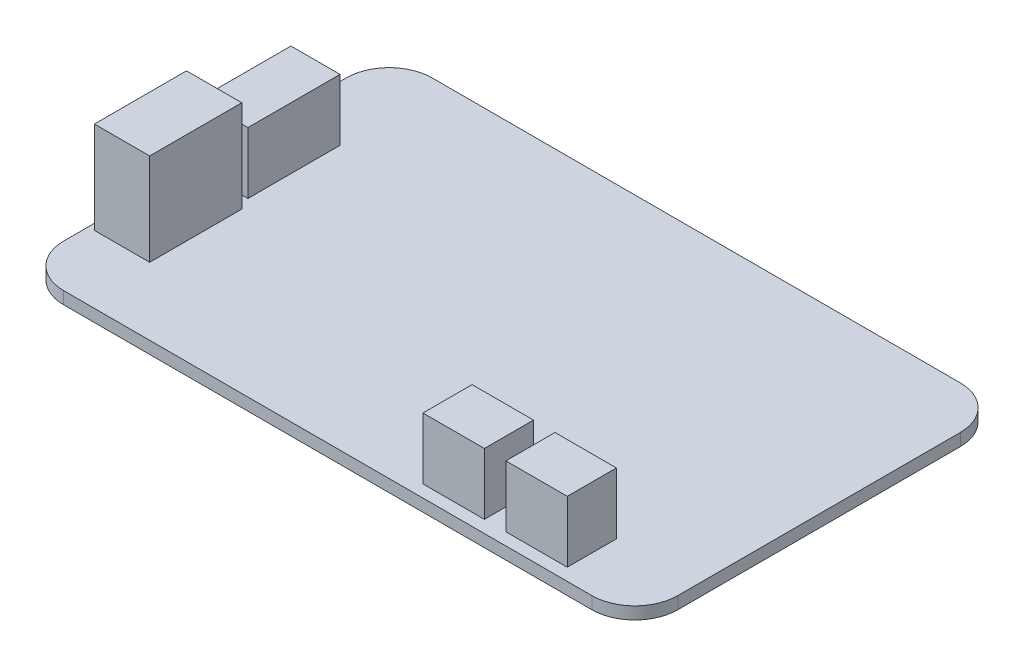
ISO-10303-21;
HEADER;
FILE_DESCRIPTION(('STEP AP214'),'2;1');
FILE_NAME('part.step','',(''),(''),'','','');
FILE_SCHEMA(('AUTOMOTIVE_DESIGN { 1 0 10303 214 1 1 1 1 }'));
ENDSEC;
DATA;
#1=APPLICATION_CONTEXT('core data for automotive mechanical design processes');
#2=APPLICATION_PROTOCOL_DEFINITION('international standard','automotive_design',2000,#1);
#3=PRODUCT_CONTEXT('',#1,'mechanical');
#4=PRODUCT('Part','Part','',(#3));
#5=PRODUCT_RELATED_PRODUCT_CATEGORY('part','',(#4));
#6=PRODUCT_DEFINITION_FORMATION('','',#4);
#7=PRODUCT_DEFINITION_CONTEXT('part definition',#1,'design');
#8=PRODUCT_DEFINITION('design','',#6,#7);
#9=PRODUCT_DEFINITION_SHAPE('','',#8);
#10=(LENGTH_UNIT() NAMED_UNIT(*) SI_UNIT(.MILLI.,.METRE.));
#11=(NAMED_UNIT(*) PLANE_ANGLE_UNIT() SI_UNIT($,.RADIAN.));
#12=(NAMED_UNIT(*) SI_UNIT($,.STERADIAN.) SOLID_ANGLE_UNIT());
#13=UNCERTAINTY_MEASURE_WITH_UNIT(LENGTH_MEASURE(1.E-05),#10,'distance_accuracy_value','');
#14=(GEOMETRIC_REPRESENTATION_CONTEXT(3) GLOBAL_UNCERTAINTY_ASSIGNED_CONTEXT((#13)) GLOBAL_UNIT_ASSIGNED_CONTEXT((#10,
#11,#12)) REPRESENTATION_CONTEXT('',''));
#15=CARTESIAN_POINT('',(0.,0.,0.));
#16=DIRECTION('',(0.,0.,1.));
#17=DIRECTION('',(1.,0.,0.));
#18=AXIS2_PLACEMENT_3D('',#15,#16,#17);
#19=CARTESIAN_POINT('',(0.,2.,0.));
#20=DIRECTION('',(0.,1.,0.));
#21=DIRECTION('',(0.,0.,1.));
#22=AXIS2_PLACEMENT_3D('',#19,#20,#21);
#23=PLANE('',#22);
#24=DIRECTION('',(0.,0.,1.));
#25=VECTOR('',#24,1.);
#26=CARTESIAN_POINT('',(-50.,2.,-30.));
#27=LINE('',#26,#25);
#28=CARTESIAN_POINT('',(-50.,2.,-23.));
#29=VERTEX_POINT('',#28);
#30=CARTESIAN_POINT('',(-50.,2.,23.));
#31=VERTEX_POINT('',#30);
#32=EDGE_CURVE('E358',#29,#31,#27,.T.);
#33=ORIENTED_EDGE('',*,*,#32,.T.);
#34=CARTESIAN_POINT('',(-43.,2.,23.));
#35=DIRECTION('',(0.,1.,0.));
#36=DIRECTION('',(0.,0.,1.));
#37=AXIS2_PLACEMENT_3D('',#34,#35,#36);
#38=CIRCLE('',#37,7.);
#39=CARTESIAN_POINT('',(-43.,2.,30.));
#40=VERTEX_POINT('',#39);
#41=EDGE_CURVE('E11',#31,#40,#38,.T.);
#42=ORIENTED_EDGE('',*,*,#41,.T.);
#43=DIRECTION('',(1.,0.,0.));
#44=VECTOR('',#43,1.);
#45=CARTESIAN_POINT('',(-50.,2.,30.));
#46=LINE('',#45,#44);
#47=CARTESIAN_POINT('',(43.,2.,30.));
#48=VERTEX_POINT('',#47);
#49=EDGE_CURVE('E362',#40,#48,#46,.T.);
#50=ORIENTED_EDGE('',*,*,#49,.T.);
#51=CARTESIAN_POINT('',(43.,2.,23.));
#52=DIRECTION('',(0.,1.,0.));
#53=DIRECTION('',(0.,0.,1.));
#54=AXIS2_PLACEMENT_3D('',#51,#52,#53);
#55=CIRCLE('',#54,7.);
#56=CARTESIAN_POINT('',(50.,2.,23.));
#57=VERTEX_POINT('',#56);
#58=EDGE_CURVE('E399',#48,#57,#55,.T.);
#59=ORIENTED_EDGE('',*,*,#58,.T.);
#60=DIRECTION('',(0.,0.,-1.));
#61=VECTOR('',#60,1.);
#62=CARTESIAN_POINT('',(50.,2.,-30.));
#63=LINE('',#62,#61);
#64=CARTESIAN_POINT('',(50.,2.,-23.));
#65=VERTEX_POINT('',#64);
#66=EDGE_CURVE('E366',#57,#65,#63,.T.);
#67=ORIENTED_EDGE('',*,*,#66,.T.);
#68=CARTESIAN_POINT('',(43.,2.,-23.));
#69=DIRECTION('',(0.,1.,0.));
#70=DIRECTION('',(0.,0.,1.));
#71=AXIS2_PLACEMENT_3D('',#68,#69,#70);
#72=CIRCLE('',#71,7.);
#73=CARTESIAN_POINT('',(43.,2.,-30.));
#74=VERTEX_POINT('',#73);
#75=EDGE_CURVE('E413',#65,#74,#72,.T.);
#76=ORIENTED_EDGE('',*,*,#75,.T.);
#77=DIRECTION('',(-1.,0.,0.));
#78=VECTOR('',#77,1.);
#79=CARTESIAN_POINT('',(-50.,2.,-30.));
#80=LINE('',#79,#78);
#81=CARTESIAN_POINT('',(-43.,2.,-30.));
#82=VERTEX_POINT('',#81);
#83=EDGE_CURVE('E370',#74,#82,#80,.T.);
#84=ORIENTED_EDGE('',*,*,#83,.T.);
#85=CARTESIAN_POINT('',(-43.,2.,-23.));
#86=DIRECTION('',(0.,1.,0.));
#87=DIRECTION('',(0.,0.,1.));
#88=AXIS2_PLACEMENT_3D('',#85,#86,#87);
#89=CIRCLE('',#88,7.);
#90=EDGE_CURVE('E427',#82,#29,#89,.T.);
#91=ORIENTED_EDGE('',*,*,#90,.T.);
#92=EDGE_LOOP('',(#33,#42,#50,#59,#67,#76,#84,#91));
#93=FACE_BOUND('',#92,.T.);
#94=DIRECTION('',(1.,0.,0.));
#95=VECTOR('',#94,1.);
#96=CARTESIAN_POINT('',(-49.,2.,2.));
#97=LINE('',#96,#95);
#98=CARTESIAN_POINT('',(-49.,2.,2.));
#99=VERTEX_POINT('',#98);
#100=CARTESIAN_POINT('',(-41.,2.,2.));
#101=VERTEX_POINT('',#100);
#102=EDGE_CURVE('E335',#99,#101,#97,.T.);
#103=ORIENTED_EDGE('',*,*,#102,.F.);
#104=DIRECTION('',(0.,0.,1.));
#105=VECTOR('',#104,1.);
#106=CARTESIAN_POINT('',(-49.,2.,-13.));
#107=LINE('',#106,#105);
#108=CARTESIAN_POINT('',(-49.,2.,-13.));
#109=VERTEX_POINT('',#108);
#110=EDGE_CURVE('E316',#109,#99,#107,.T.);
#111=ORIENTED_EDGE('',*,*,#110,.F.);
#112=DIRECTION('',(-1.,0.,0.));
#113=VECTOR('',#112,1.);
#114=CARTESIAN_POINT('',(-49.,2.,-13.));
#115=LINE('',#114,#113);
#116=CARTESIAN_POINT('',(-41.,2.,-13.));
#117=VERTEX_POINT('',#116);
#118=EDGE_CURVE('E322',#117,#109,#115,.T.);
#119=ORIENTED_EDGE('',*,*,#118,.F.);
#120=DIRECTION('',(0.,0.,-1.));
#121=VECTOR('',#120,1.);
#122=CARTESIAN_POINT('',(-41.,2.,-13.));
#123=LINE('',#122,#121);
#124=EDGE_CURVE('E338',#101,#117,#123,.T.);
#125=ORIENTED_EDGE('',*,*,#124,.F.);
#126=EDGE_LOOP('',(#103,#111,#119,#125));
#127=FACE_BOUND('',#126,.T.);
#128=DIRECTION('',(1.,0.,0.));
#129=VECTOR('',#128,1.);
#130=CARTESIAN_POINT('',(-49.,2.,19.));
#131=LINE('',#130,#129);
#132=CARTESIAN_POINT('',(-49.,2.,19.));
#133=VERTEX_POINT('',#132);
#134=CARTESIAN_POINT('',(-40.,2.,19.));
#135=VERTEX_POINT('',#134);
#136=EDGE_CURVE('E294',#133,#135,#131,.T.);
#137=ORIENTED_EDGE('',*,*,#136,.F.);
#138=DIRECTION('',(0.,0.,1.));
#139=VECTOR('',#138,1.);
#140=CARTESIAN_POINT('',(-49.,2.,4.));
#141=LINE('',#140,#139);
#142=CARTESIAN_POINT('',(-49.,2.,4.));
#143=VERTEX_POINT('',#142);
#144=EDGE_CURVE('E275',#143,#133,#141,.T.);
#145=ORIENTED_EDGE('',*,*,#144,.F.);
#146=DIRECTION('',(-1.,0.,0.));
#147=VECTOR('',#146,1.);
#148=CARTESIAN_POINT('',(-49.,2.,4.));
#149=LINE('',#148,#147);
#150=CARTESIAN_POINT('',(-40.,2.,4.));
#151=VERTEX_POINT('',#150);
#152=EDGE_CURVE('E281',#151,#143,#149,.T.);
#153=ORIENTED_EDGE('',*,*,#152,.F.);
#154=DIRECTION('',(0.,0.,-1.));
#155=VECTOR('',#154,1.);
#156=CARTESIAN_POINT('',(-40.,2.,4.));
#157=LINE('',#156,#155);
#158=EDGE_CURVE('E297',#135,#151,#157,.T.);
#159=ORIENTED_EDGE('',*,*,#158,.F.);
#160=EDGE_LOOP('',(#137,#145,#153,#159));
#161=FACE_BOUND('',#160,.T.);
#162=DIRECTION('',(1.,0.,0.));
#163=VECTOR('',#162,1.);
#164=CARTESIAN_POINT('',(27.,2.,28.));
#165=LINE('',#164,#163);
#166=CARTESIAN_POINT('',(27.,2.,28.));
#167=VERTEX_POINT('',#166);
#168=CARTESIAN_POINT('',(37.,2.,28.));
#169=VERTEX_POINT('',#168);
#170=EDGE_CURVE('E236',#167,#169,#165,.T.);
#171=ORIENTED_EDGE('',*,*,#170,.F.);
#172=DIRECTION('',(0.,0.,1.));
#173=VECTOR('',#172,1.);
#174=CARTESIAN_POINT('',(27.,2.,20.));
#175=LINE('',#174,#173);
#176=CARTESIAN_POINT('',(27.,2.,20.));
#177=VERTEX_POINT('',#176);
#178=EDGE_CURVE('E231',#177,#167,#175,.T.);
#179=ORIENTED_EDGE('',*,*,#178,.F.);
#180=DIRECTION('',(-1.,0.,0.));
#181=VECTOR('',#180,1.);
#182=CARTESIAN_POINT('',(27.,2.,20.));
#183=LINE('',#182,#181);
#184=CARTESIAN_POINT('',(37.,2.,20.));
#185=VERTEX_POINT('',#184);
#186=EDGE_CURVE('E246',#185,#177,#183,.T.);
#187=ORIENTED_EDGE('',*,*,#186,.F.);
#188=DIRECTION('',(0.,0.,-1.));
#189=VECTOR('',#188,1.);
#190=CARTESIAN_POINT('',(37.,2.,20.));
#191=LINE('',#190,#189);
#192=EDGE_CURVE('E258',#169,#185,#191,.T.);
#193=ORIENTED_EDGE('',*,*,#192,.F.);
#194=EDGE_LOOP('',(#171,#179,#187,#193));
#195=FACE_BOUND('',#194,.T.);
#196=DIRECTION('',(0.,0.,1.));
#197=VECTOR('',#196,1.);
#198=CARTESIAN_POINT('',(13.5,2.,20.));
#199=LINE('',#198,#197);
#200=CARTESIAN_POINT('',(13.5,2.,20.));
#201=VERTEX_POINT('',#200);
#202=CARTESIAN_POINT('',(13.5,2.,28.));
#203=VERTEX_POINT('',#202);
#204=EDGE_CURVE('E489',#201,#203,#199,.T.);
#205=ORIENTED_EDGE('',*,*,#204,.F.);
#206=DIRECTION('',(-1.,0.,0.));
#207=VECTOR('',#206,1.);
#208=CARTESIAN_POINT('',(23.5,2.,20.));
#209=LINE('',#208,#207);
#210=CARTESIAN_POINT('',(23.5,2.,20.));
#211=VERTEX_POINT('',#210);
#212=EDGE_CURVE('E228',#211,#201,#209,.T.);
#213=ORIENTED_EDGE('',*,*,#212,.F.);
#214=DIRECTION('',(0.,0.,-1.));
#215=VECTOR('',#214,1.);
#216=CARTESIAN_POINT('',(23.5,2.,20.));
#217=LINE('',#216,#215);
#218=CARTESIAN_POINT('',(23.5,2.,28.));
#219=VERTEX_POINT('',#218);
#220=EDGE_CURVE('E224',#219,#211,#217,.T.);
#221=ORIENTED_EDGE('',*,*,#220,.F.);
#222=DIRECTION('',(1.,0.,0.));
#223=VECTOR('',#222,1.);
#224=CARTESIAN_POINT('',(23.5,2.,28.));
#225=LINE('',#224,#223);
#226=EDGE_CURVE('E491',#203,#219,#225,.T.);
#227=ORIENTED_EDGE('',*,*,#226,.F.);
#228=EDGE_LOOP('',(#205,#213,#221,#227));
#229=FACE_BOUND('',#228,.T.);
#230=ADVANCED_FACE('F41',(#93,#127,#161,#195,#229),#23,.T.);
#231=CARTESIAN_POINT('',(-43.,2.,23.));
#232=DIRECTION('',(0.,1.,0.));
#233=DIRECTION('',(0.,0.,1.));
#234=AXIS2_PLACEMENT_3D('',#231,#232,#233);
#235=CYLINDRICAL_SURFACE('',#234,7.);
#236=DIRECTION('',(0.,1.,0.));
#237=VECTOR('',#236,1.);
#238=CARTESIAN_POINT('',(-50.,2.,23.));
#239=LINE('',#238,#237);
#240=CARTESIAN_POINT('',(-50.,0.,23.));
#241=VERTEX_POINT('',#240);
#242=EDGE_CURVE('E430',#241,#31,#239,.T.);
#243=ORIENTED_EDGE('',*,*,#242,.F.);
#244=CARTESIAN_POINT('',(-43.,0.,23.));
#245=DIRECTION('',(0.,1.,0.));
#246=DIRECTION('',(0.,0.,1.));
#247=AXIS2_PLACEMENT_3D('',#244,#245,#246);
#248=CIRCLE('',#247,7.);
#249=CARTESIAN_POINT('',(-43.,0.,30.));
#250=VERTEX_POINT('',#249);
#251=EDGE_CURVE('E50',#250,#241,#248,.F.);
#252=ORIENTED_EDGE('',*,*,#251,.F.);
#253=DIRECTION('',(0.,1.,0.));
#254=VECTOR('',#253,1.);
#255=CARTESIAN_POINT('',(-43.,2.,30.));
#256=LINE('',#255,#254);
#257=EDGE_CURVE('E434',#40,#250,#256,.F.);
#258=ORIENTED_EDGE('',*,*,#257,.F.);
#259=ORIENTED_EDGE('',*,*,#41,.F.);
#260=EDGE_LOOP('',(#243,#252,#258,#259));
#261=FACE_BOUND('',#260,.T.);
#262=ADVANCED_FACE('F43',(#261),#235,.T.);
#263=CARTESIAN_POINT('',(-43.,2.,-23.));
#264=DIRECTION('',(0.,1.,0.));
#265=DIRECTION('',(0.,0.,1.));
#266=AXIS2_PLACEMENT_3D('',#263,#264,#265);
#267=CYLINDRICAL_SURFACE('',#266,7.);
#268=DIRECTION('',(0.,1.,0.));
#269=VECTOR('',#268,1.);
#270=CARTESIAN_POINT('',(-43.,2.,-30.));
#271=LINE('',#270,#269);
#272=CARTESIAN_POINT('',(-43.,0.,-30.));
#273=VERTEX_POINT('',#272);
#274=EDGE_CURVE('E416',#273,#82,#271,.T.);
#275=ORIENTED_EDGE('',*,*,#274,.F.);
#276=CARTESIAN_POINT('',(-43.,0.,-23.));
#277=DIRECTION('',(0.,1.,0.));
#278=DIRECTION('',(0.,0.,1.));
#279=AXIS2_PLACEMENT_3D('',#276,#277,#278);
#280=CIRCLE('',#279,7.);
#281=CARTESIAN_POINT('',(-50.,0.,-23.));
#282=VERTEX_POINT('',#281);
#283=EDGE_CURVE('E424',#282,#273,#280,.F.);
#284=ORIENTED_EDGE('',*,*,#283,.F.);
#285=DIRECTION('',(0.,1.,0.));
#286=VECTOR('',#285,1.);
#287=CARTESIAN_POINT('',(-50.,2.,-23.));
#288=LINE('',#287,#286);
#289=EDGE_CURVE('E420',#29,#282,#288,.F.);
#290=ORIENTED_EDGE('',*,*,#289,.F.);
#291=ORIENTED_EDGE('',*,*,#90,.F.);
#292=EDGE_LOOP('',(#275,#284,#290,#291));
#293=FACE_BOUND('',#292,.T.);
#294=ADVANCED_FACE('F451',(#293),#267,.T.);
#295=CARTESIAN_POINT('',(43.,2.,-23.));
#296=DIRECTION('',(0.,1.,0.));
#297=DIRECTION('',(0.,0.,1.));
#298=AXIS2_PLACEMENT_3D('',#295,#296,#297);
#299=CYLINDRICAL_SURFACE('',#298,7.);
#300=DIRECTION('',(0.,1.,0.));
#301=VECTOR('',#300,1.);
#302=CARTESIAN_POINT('',(50.,2.,-23.));
#303=LINE('',#302,#301);
#304=CARTESIAN_POINT('',(50.,0.,-23.));
#305=VERTEX_POINT('',#304);
#306=EDGE_CURVE('E402',#305,#65,#303,.T.);
#307=ORIENTED_EDGE('',*,*,#306,.F.);
#308=CARTESIAN_POINT('',(43.,0.,-23.));
#309=DIRECTION('',(0.,1.,0.));
#310=DIRECTION('',(0.,0.,1.));
#311=AXIS2_PLACEMENT_3D('',#308,#309,#310);
#312=CIRCLE('',#311,7.);
#313=CARTESIAN_POINT('',(43.,0.,-30.));
#314=VERTEX_POINT('',#313);
#315=EDGE_CURVE('E410',#314,#305,#312,.F.);
#316=ORIENTED_EDGE('',*,*,#315,.F.);
#317=DIRECTION('',(0.,1.,0.));
#318=VECTOR('',#317,1.);
#319=CARTESIAN_POINT('',(43.,2.,-30.));
#320=LINE('',#319,#318);
#321=EDGE_CURVE('E406',#74,#314,#320,.F.);
#322=ORIENTED_EDGE('',*,*,#321,.F.);
#323=ORIENTED_EDGE('',*,*,#75,.F.);
#324=EDGE_LOOP('',(#307,#316,#322,#323));
#325=FACE_BOUND('',#324,.T.);
#326=ADVANCED_FACE('F460',(#325),#299,.T.);
#327=CARTESIAN_POINT('',(43.,2.,23.));
#328=DIRECTION('',(0.,1.,0.));
#329=DIRECTION('',(0.,0.,1.));
#330=AXIS2_PLACEMENT_3D('',#327,#328,#329);
#331=CYLINDRICAL_SURFACE('',#330,7.);
#332=DIRECTION('',(0.,1.,0.));
#333=VECTOR('',#332,1.);
#334=CARTESIAN_POINT('',(43.,2.,30.));
#335=LINE('',#334,#333);
#336=CARTESIAN_POINT('',(43.,0.,30.));
#337=VERTEX_POINT('',#336);
#338=EDGE_CURVE('E374',#337,#48,#335,.T.);
#339=ORIENTED_EDGE('',*,*,#338,.F.);
#340=CARTESIAN_POINT('',(43.,0.,23.));
#341=DIRECTION('',(0.,1.,0.));
#342=DIRECTION('',(0.,0.,1.));
#343=AXIS2_PLACEMENT_3D('',#340,#341,#342);
#344=CIRCLE('',#343,7.);
#345=CARTESIAN_POINT('',(50.,0.,23.));
#346=VERTEX_POINT('',#345);
#347=EDGE_CURVE('E395',#346,#337,#344,.F.);
#348=ORIENTED_EDGE('',*,*,#347,.F.);
#349=DIRECTION('',(0.,1.,0.));
#350=VECTOR('',#349,1.);
#351=CARTESIAN_POINT('',(50.,2.,23.));
#352=LINE('',#351,#350);
#353=EDGE_CURVE('E391',#57,#346,#352,.F.);
#354=ORIENTED_EDGE('',*,*,#353,.F.);
#355=ORIENTED_EDGE('',*,*,#58,.F.);
#356=EDGE_LOOP('',(#339,#348,#354,#355));
#357=FACE_BOUND('',#356,.T.);
#358=ADVANCED_FACE('F468',(#357),#331,.T.);
#359=CARTESIAN_POINT('',(-50.,2.,-30.));
#360=DIRECTION('',(1.,0.,0.));
#361=DIRECTION('',(0.,0.,-1.));
#362=AXIS2_PLACEMENT_3D('',#359,#360,#361);
#363=PLANE('',#362);
#364=DIRECTION('',(0.,0.,1.));
#365=VECTOR('',#364,1.);
#366=CARTESIAN_POINT('',(-50.,0.,-30.));
#367=LINE('',#366,#365);
#368=EDGE_CURVE('E357',#282,#241,#367,.T.);
#369=ORIENTED_EDGE('',*,*,#368,.T.);
#370=ORIENTED_EDGE('',*,*,#242,.T.);
#371=ORIENTED_EDGE('',*,*,#32,.F.);
#372=ORIENTED_EDGE('',*,*,#289,.T.);
#373=EDGE_LOOP('',(#369,#370,#371,#372));
#374=FACE_BOUND('',#373,.T.);
#375=ADVANCED_FACE('F447',(#374),#363,.F.);
#376=CARTESIAN_POINT('',(-50.,2.,30.));
#377=DIRECTION('',(0.,0.,-1.));
#378=DIRECTION('',(-1.,0.,0.));
#379=AXIS2_PLACEMENT_3D('',#376,#377,#378);
#380=PLANE('',#379);
#381=ORIENTED_EDGE('',*,*,#49,.F.);
#382=ORIENTED_EDGE('',*,*,#257,.T.);
#383=DIRECTION('',(1.,0.,0.));
#384=VECTOR('',#383,1.);
#385=CARTESIAN_POINT('',(-50.,0.,30.));
#386=LINE('',#385,#384);
#387=EDGE_CURVE('E378',#250,#337,#386,.T.);
#388=ORIENTED_EDGE('',*,*,#387,.T.);
#389=ORIENTED_EDGE('',*,*,#338,.T.);
#390=EDGE_LOOP('',(#381,#382,#388,#389));
#391=FACE_BOUND('',#390,.T.);
#392=ADVANCED_FACE('F471',(#391),#380,.F.);
#393=CARTESIAN_POINT('',(50.,2.,-30.));
#394=DIRECTION('',(-1.,0.,0.));
#395=DIRECTION('',(0.,0.,1.));
#396=AXIS2_PLACEMENT_3D('',#393,#394,#395);
#397=PLANE('',#396);
#398=DIRECTION('',(0.,0.,-1.));
#399=VECTOR('',#398,1.);
#400=CARTESIAN_POINT('',(50.,0.,-30.));
#401=LINE('',#400,#399);
#402=EDGE_CURVE('E381',#346,#305,#401,.T.);
#403=ORIENTED_EDGE('',*,*,#402,.T.);
#404=ORIENTED_EDGE('',*,*,#306,.T.);
#405=ORIENTED_EDGE('',*,*,#66,.F.);
#406=ORIENTED_EDGE('',*,*,#353,.T.);
#407=EDGE_LOOP('',(#403,#404,#405,#406));
#408=FACE_BOUND('',#407,.T.);
#409=ADVANCED_FACE('F463',(#408),#397,.F.);
#410=CARTESIAN_POINT('',(-50.,2.,-30.));
#411=DIRECTION('',(0.,0.,1.));
#412=DIRECTION('',(1.,0.,0.));
#413=AXIS2_PLACEMENT_3D('',#410,#411,#412);
#414=PLANE('',#413);
#415=DIRECTION('',(-1.,0.,0.));
#416=VECTOR('',#415,1.);
#417=CARTESIAN_POINT('',(-50.,0.,-30.));
#418=LINE('',#417,#416);
#419=EDGE_CURVE('E363',#314,#273,#418,.T.);
#420=ORIENTED_EDGE('',*,*,#419,.T.);
#421=ORIENTED_EDGE('',*,*,#274,.T.);
#422=ORIENTED_EDGE('',*,*,#83,.F.);
#423=ORIENTED_EDGE('',*,*,#321,.T.);
#424=EDGE_LOOP('',(#420,#421,#422,#423));
#425=FACE_BOUND('',#424,.T.);
#426=ADVANCED_FACE('F456',(#425),#414,.F.);
#427=CARTESIAN_POINT('',(0.,0.,0.));
#428=DIRECTION('',(0.,1.,0.));
#429=DIRECTION('',(0.,0.,1.));
#430=AXIS2_PLACEMENT_3D('',#427,#428,#429);
#431=PLANE('',#430);
#432=ORIENTED_EDGE('',*,*,#387,.F.);
#433=ORIENTED_EDGE('',*,*,#251,.T.);
#434=ORIENTED_EDGE('',*,*,#368,.F.);
#435=ORIENTED_EDGE('',*,*,#283,.T.);
#436=ORIENTED_EDGE('',*,*,#419,.F.);
#437=ORIENTED_EDGE('',*,*,#315,.T.);
#438=ORIENTED_EDGE('',*,*,#402,.F.);
#439=ORIENTED_EDGE('',*,*,#347,.T.);
#440=EDGE_LOOP('',(#432,#433,#434,#435,#436,#437,#438,#439));
#441=FACE_BOUND('',#440,.T.);
#442=ADVANCED_FACE('F442',(#441),#431,.F.);
#443=CARTESIAN_POINT('',(-49.,12.,-13.));
#444=DIRECTION('',(1.,0.,0.));
#445=DIRECTION('',(0.,0.,-1.));
#446=AXIS2_PLACEMENT_3D('',#443,#444,#445);
#447=PLANE('',#446);
#448=ORIENTED_EDGE('',*,*,#110,.T.);
#449=DIRECTION('',(0.,-1.,0.));
#450=VECTOR('',#449,1.);
#451=CARTESIAN_POINT('',(-49.,12.,2.));
#452=LINE('',#451,#450);
#453=CARTESIAN_POINT('',(-49.,12.,2.));
#454=VERTEX_POINT('',#453);
#455=EDGE_CURVE('E354',#454,#99,#452,.T.);
#456=ORIENTED_EDGE('',*,*,#455,.F.);
#457=DIRECTION('',(0.,0.,1.));
#458=VECTOR('',#457,1.);
#459=CARTESIAN_POINT('',(-49.,12.,-13.));
#460=LINE('',#459,#458);
#461=CARTESIAN_POINT('',(-49.,12.,-13.));
#462=VERTEX_POINT('',#461);
#463=EDGE_CURVE('E317',#462,#454,#460,.T.);
#464=ORIENTED_EDGE('',*,*,#463,.F.);
#465=DIRECTION('',(0.,-1.,0.));
#466=VECTOR('',#465,1.);
#467=CARTESIAN_POINT('',(-49.,12.,-13.));
#468=LINE('',#467,#466);
#469=EDGE_CURVE('E331',#462,#109,#468,.T.);
#470=ORIENTED_EDGE('',*,*,#469,.T.);
#471=EDGE_LOOP('',(#448,#456,#464,#470));
#472=FACE_BOUND('',#471,.T.);
#473=ADVANCED_FACE('F578',(#472),#447,.F.);
#474=CARTESIAN_POINT('',(-49.,12.,2.));
#475=DIRECTION('',(0.,0.,-1.));
#476=DIRECTION('',(-1.,0.,0.));
#477=AXIS2_PLACEMENT_3D('',#474,#475,#476);
#478=PLANE('',#477);
#479=ORIENTED_EDGE('',*,*,#102,.T.);
#480=DIRECTION('',(0.,-1.,0.));
#481=VECTOR('',#480,1.);
#482=CARTESIAN_POINT('',(-41.,12.,2.));
#483=LINE('',#482,#481);
#484=CARTESIAN_POINT('',(-41.,12.,2.));
#485=VERTEX_POINT('',#484);
#486=EDGE_CURVE('E350',#485,#101,#483,.T.);
#487=ORIENTED_EDGE('',*,*,#486,.F.);
#488=DIRECTION('',(1.,0.,0.));
#489=VECTOR('',#488,1.);
#490=CARTESIAN_POINT('',(-49.,12.,2.));
#491=LINE('',#490,#489);
#492=EDGE_CURVE('E321',#454,#485,#491,.T.);
#493=ORIENTED_EDGE('',*,*,#492,.F.);
#494=ORIENTED_EDGE('',*,*,#455,.T.);
#495=EDGE_LOOP('',(#479,#487,#493,#494));
#496=FACE_BOUND('',#495,.T.);
#497=ADVANCED_FACE('F574',(#496),#478,.F.);
#498=CARTESIAN_POINT('',(-41.,12.,-13.));
#499=DIRECTION('',(-1.,0.,0.));
#500=DIRECTION('',(0.,0.,1.));
#501=AXIS2_PLACEMENT_3D('',#498,#499,#500);
#502=PLANE('',#501);
#503=ORIENTED_EDGE('',*,*,#124,.T.);
#504=DIRECTION('',(0.,-1.,0.));
#505=VECTOR('',#504,1.);
#506=CARTESIAN_POINT('',(-41.,12.,-13.));
#507=LINE('',#506,#505);
#508=CARTESIAN_POINT('',(-41.,12.,-13.));
#509=VERTEX_POINT('',#508);
#510=EDGE_CURVE('E347',#509,#117,#507,.T.);
#511=ORIENTED_EDGE('',*,*,#510,.F.);
#512=DIRECTION('',(0.,0.,-1.));
#513=VECTOR('',#512,1.);
#514=CARTESIAN_POINT('',(-41.,12.,-13.));
#515=LINE('',#514,#513);
#516=EDGE_CURVE('E325',#485,#509,#515,.T.);
#517=ORIENTED_EDGE('',*,*,#516,.F.);
#518=ORIENTED_EDGE('',*,*,#486,.T.);
#519=EDGE_LOOP('',(#503,#511,#517,#518));
#520=FACE_BOUND('',#519,.T.);
#521=ADVANCED_FACE('F570',(#520),#502,.F.);
#522=CARTESIAN_POINT('',(-49.,12.,-13.));
#523=DIRECTION('',(0.,0.,1.));
#524=DIRECTION('',(1.,0.,0.));
#525=AXIS2_PLACEMENT_3D('',#522,#523,#524);
#526=PLANE('',#525);
#527=ORIENTED_EDGE('',*,*,#118,.T.);
#528=ORIENTED_EDGE('',*,*,#469,.F.);
#529=DIRECTION('',(-1.,0.,0.));
#530=VECTOR('',#529,1.);
#531=CARTESIAN_POINT('',(-49.,12.,-13.));
#532=LINE('',#531,#530);
#533=EDGE_CURVE('E328',#509,#462,#532,.T.);
#534=ORIENTED_EDGE('',*,*,#533,.F.);
#535=ORIENTED_EDGE('',*,*,#510,.T.);
#536=EDGE_LOOP('',(#527,#528,#534,#535));
#537=FACE_BOUND('',#536,.T.);
#538=ADVANCED_FACE('F566',(#537),#526,.F.);
#539=CARTESIAN_POINT('',(0.,12.,0.));
#540=DIRECTION('',(0.,1.,0.));
#541=DIRECTION('',(0.,0.,1.));
#542=AXIS2_PLACEMENT_3D('',#539,#540,#541);
#543=PLANE('',#542);
#544=ORIENTED_EDGE('',*,*,#463,.T.);
#545=ORIENTED_EDGE('',*,*,#492,.T.);
#546=ORIENTED_EDGE('',*,*,#516,.T.);
#547=ORIENTED_EDGE('',*,*,#533,.T.);
#548=EDGE_LOOP('',(#544,#545,#546,#547));
#549=FACE_BOUND('',#548,.T.);
#550=ADVANCED_FACE('F562',(#549),#543,.T.);
#551=CARTESIAN_POINT('',(-49.,17.,4.));
#552=DIRECTION('',(1.,0.,0.));
#553=DIRECTION('',(0.,0.,-1.));
#554=AXIS2_PLACEMENT_3D('',#551,#552,#553);
#555=PLANE('',#554);
#556=ORIENTED_EDGE('',*,*,#144,.T.);
#557=DIRECTION('',(0.,-1.,0.));
#558=VECTOR('',#557,1.);
#559=CARTESIAN_POINT('',(-49.,17.,19.));
#560=LINE('',#559,#558);
#561=CARTESIAN_POINT('',(-49.,17.,19.));
#562=VERTEX_POINT('',#561);
#563=EDGE_CURVE('E313',#562,#133,#560,.T.);
#564=ORIENTED_EDGE('',*,*,#563,.F.);
#565=DIRECTION('',(0.,0.,1.));
#566=VECTOR('',#565,1.);
#567=CARTESIAN_POINT('',(-49.,17.,4.));
#568=LINE('',#567,#566);
#569=CARTESIAN_POINT('',(-49.,17.,4.));
#570=VERTEX_POINT('',#569);
#571=EDGE_CURVE('E276',#570,#562,#568,.T.);
#572=ORIENTED_EDGE('',*,*,#571,.F.);
#573=DIRECTION('',(0.,-1.,0.));
#574=VECTOR('',#573,1.);
#575=CARTESIAN_POINT('',(-49.,17.,4.));
#576=LINE('',#575,#574);
#577=EDGE_CURVE('E290',#570,#143,#576,.T.);
#578=ORIENTED_EDGE('',*,*,#577,.T.);
#579=EDGE_LOOP('',(#556,#564,#572,#578));
#580=FACE_BOUND('',#579,.T.);
#581=ADVANCED_FACE('F558',(#580),#555,.F.);
#582=CARTESIAN_POINT('',(-49.,17.,19.));
#583=DIRECTION('',(0.,0.,-1.));
#584=DIRECTION('',(-1.,0.,0.));
#585=AXIS2_PLACEMENT_3D('',#582,#583,#584);
#586=PLANE('',#585);
#587=ORIENTED_EDGE('',*,*,#136,.T.);
#588=DIRECTION('',(0.,-1.,0.));
#589=VECTOR('',#588,1.);
#590=CARTESIAN_POINT('',(-40.,17.,19.));
#591=LINE('',#590,#589);
#592=CARTESIAN_POINT('',(-40.,17.,19.));
#593=VERTEX_POINT('',#592);
#594=EDGE_CURVE('E309',#593,#135,#591,.T.);
#595=ORIENTED_EDGE('',*,*,#594,.F.);
#596=DIRECTION('',(1.,0.,0.));
#597=VECTOR('',#596,1.);
#598=CARTESIAN_POINT('',(-49.,17.,19.));
#599=LINE('',#598,#597);
#600=EDGE_CURVE('E280',#562,#593,#599,.T.);
#601=ORIENTED_EDGE('',*,*,#600,.F.);
#602=ORIENTED_EDGE('',*,*,#563,.T.);
#603=EDGE_LOOP('',(#587,#595,#601,#602));
#604=FACE_BOUND('',#603,.T.);
#605=ADVANCED_FACE('F554',(#604),#586,.F.);
#606=CARTESIAN_POINT('',(-40.,17.,4.));
#607=DIRECTION('',(-1.,0.,0.));
#608=DIRECTION('',(0.,0.,1.));
#609=AXIS2_PLACEMENT_3D('',#606,#607,#608);
#610=PLANE('',#609);
#611=ORIENTED_EDGE('',*,*,#158,.T.);
#612=DIRECTION('',(0.,-1.,0.));
#613=VECTOR('',#612,1.);
#614=CARTESIAN_POINT('',(-40.,17.,4.));
#615=LINE('',#614,#613);
#616=CARTESIAN_POINT('',(-40.,17.,4.));
#617=VERTEX_POINT('',#616);
#618=EDGE_CURVE('E306',#617,#151,#615,.T.);
#619=ORIENTED_EDGE('',*,*,#618,.F.);
#620=DIRECTION('',(0.,0.,-1.));
#621=VECTOR('',#620,1.);
#622=CARTESIAN_POINT('',(-40.,17.,4.));
#623=LINE('',#622,#621);
#624=EDGE_CURVE('E284',#593,#617,#623,.T.);
#625=ORIENTED_EDGE('',*,*,#624,.F.);
#626=ORIENTED_EDGE('',*,*,#594,.T.);
#627=EDGE_LOOP('',(#611,#619,#625,#626));
#628=FACE_BOUND('',#627,.T.);
#629=ADVANCED_FACE('F550',(#628),#610,.F.);
#630=CARTESIAN_POINT('',(-49.,17.,4.));
#631=DIRECTION('',(0.,0.,1.));
#632=DIRECTION('',(1.,0.,0.));
#633=AXIS2_PLACEMENT_3D('',#630,#631,#632);
#634=PLANE('',#633);
#635=ORIENTED_EDGE('',*,*,#152,.T.);
#636=ORIENTED_EDGE('',*,*,#577,.F.);
#637=DIRECTION('',(-1.,0.,0.));
#638=VECTOR('',#637,1.);
#639=CARTESIAN_POINT('',(-49.,17.,4.));
#640=LINE('',#639,#638);
#641=EDGE_CURVE('E287',#617,#570,#640,.T.);
#642=ORIENTED_EDGE('',*,*,#641,.F.);
#643=ORIENTED_EDGE('',*,*,#618,.T.);
#644=EDGE_LOOP('',(#635,#636,#642,#643));
#645=FACE_BOUND('',#644,.T.);
#646=ADVANCED_FACE('F546',(#645),#634,.F.);
#647=CARTESIAN_POINT('',(0.,17.,0.));
#648=DIRECTION('',(0.,1.,0.));
#649=DIRECTION('',(0.,0.,1.));
#650=AXIS2_PLACEMENT_3D('',#647,#648,#649);
#651=PLANE('',#650);
#652=ORIENTED_EDGE('',*,*,#571,.T.);
#653=ORIENTED_EDGE('',*,*,#600,.T.);
#654=ORIENTED_EDGE('',*,*,#624,.T.);
#655=ORIENTED_EDGE('',*,*,#641,.T.);
#656=EDGE_LOOP('',(#652,#653,#654,#655));
#657=FACE_BOUND('',#656,.T.);
#658=ADVANCED_FACE('F542',(#657),#651,.T.);
#659=CARTESIAN_POINT('',(27.,12.,20.));
#660=DIRECTION('',(1.,0.,0.));
#661=DIRECTION('',(0.,0.,-1.));
#662=AXIS2_PLACEMENT_3D('',#659,#660,#661);
#663=PLANE('',#662);
#664=ORIENTED_EDGE('',*,*,#178,.T.);
#665=DIRECTION('',(0.,-1.,0.));
#666=VECTOR('',#665,1.);
#667=CARTESIAN_POINT('',(27.,12.,28.));
#668=LINE('',#667,#666);
#669=CARTESIAN_POINT('',(27.,12.,28.));
#670=VERTEX_POINT('',#669);
#671=EDGE_CURVE('E272',#670,#167,#668,.T.);
#672=ORIENTED_EDGE('',*,*,#671,.F.);
#673=DIRECTION('',(0.,0.,1.));
#674=VECTOR('',#673,1.);
#675=CARTESIAN_POINT('',(27.,12.,20.));
#676=LINE('',#675,#674);
#677=CARTESIAN_POINT('',(27.,12.,20.));
#678=VERTEX_POINT('',#677);
#679=EDGE_CURVE('E241',#678,#670,#676,.T.);
#680=ORIENTED_EDGE('',*,*,#679,.F.);
#681=DIRECTION('',(0.,-1.,0.));
#682=VECTOR('',#681,1.);
#683=CARTESIAN_POINT('',(27.,12.,20.));
#684=LINE('',#683,#682);
#685=EDGE_CURVE('E254',#678,#177,#684,.T.);
#686=ORIENTED_EDGE('',*,*,#685,.T.);
#687=EDGE_LOOP('',(#664,#672,#680,#686));
#688=FACE_BOUND('',#687,.T.);
#689=ADVANCED_FACE('F538',(#688),#663,.F.);
#690=CARTESIAN_POINT('',(27.,12.,28.));
#691=DIRECTION('',(0.,0.,-1.));
#692=DIRECTION('',(-1.,0.,0.));
#693=AXIS2_PLACEMENT_3D('',#690,#691,#692);
#694=PLANE('',#693);
#695=ORIENTED_EDGE('',*,*,#170,.T.);
#696=DIRECTION('',(0.,-1.,0.));
#697=VECTOR('',#696,1.);
#698=CARTESIAN_POINT('',(37.,12.,28.));
#699=LINE('',#698,#697);
#700=CARTESIAN_POINT('',(37.,12.,28.));
#701=VERTEX_POINT('',#700);
#702=EDGE_CURVE('E268',#701,#169,#699,.T.);
#703=ORIENTED_EDGE('',*,*,#702,.F.);
#704=DIRECTION('',(1.,0.,0.));
#705=VECTOR('',#704,1.);
#706=CARTESIAN_POINT('',(27.,12.,28.));
#707=LINE('',#706,#705);
#708=EDGE_CURVE('E245',#670,#701,#707,.T.);
#709=ORIENTED_EDGE('',*,*,#708,.F.);
#710=ORIENTED_EDGE('',*,*,#671,.T.);
#711=EDGE_LOOP('',(#695,#703,#709,#710));
#712=FACE_BOUND('',#711,.T.);
#713=ADVANCED_FACE('F534',(#712),#694,.F.);
#714=CARTESIAN_POINT('',(37.,12.,20.));
#715=DIRECTION('',(-1.,0.,0.));
#716=DIRECTION('',(0.,0.,1.));
#717=AXIS2_PLACEMENT_3D('',#714,#715,#716);
#718=PLANE('',#717);
#719=ORIENTED_EDGE('',*,*,#192,.T.);
#720=DIRECTION('',(0.,-1.,0.));
#721=VECTOR('',#720,1.);
#722=CARTESIAN_POINT('',(37.,12.,20.));
#723=LINE('',#722,#721);
#724=CARTESIAN_POINT('',(37.,12.,20.));
#725=VERTEX_POINT('',#724);
#726=EDGE_CURVE('E65',#725,#185,#723,.T.);
#727=ORIENTED_EDGE('',*,*,#726,.F.);
#728=DIRECTION('',(0.,0.,-1.));
#729=VECTOR('',#728,1.);
#730=CARTESIAN_POINT('',(37.,12.,20.));
#731=LINE('',#730,#729);
#732=EDGE_CURVE('E249',#701,#725,#731,.T.);
#733=ORIENTED_EDGE('',*,*,#732,.F.);
#734=ORIENTED_EDGE('',*,*,#702,.T.);
#735=EDGE_LOOP('',(#719,#727,#733,#734));
#736=FACE_BOUND('',#735,.T.);
#737=ADVANCED_FACE('F531',(#736),#718,.F.);
#738=CARTESIAN_POINT('',(27.,12.,20.));
#739=DIRECTION('',(0.,0.,1.));
#740=DIRECTION('',(1.,0.,0.));
#741=AXIS2_PLACEMENT_3D('',#738,#739,#740);
#742=PLANE('',#741);
#743=ORIENTED_EDGE('',*,*,#186,.T.);
#744=ORIENTED_EDGE('',*,*,#685,.F.);
#745=DIRECTION('',(-1.,0.,0.));
#746=VECTOR('',#745,1.);
#747=CARTESIAN_POINT('',(27.,12.,20.));
#748=LINE('',#747,#746);
#749=EDGE_CURVE('E252',#725,#678,#748,.T.);
#750=ORIENTED_EDGE('',*,*,#749,.F.);
#751=ORIENTED_EDGE('',*,*,#726,.T.);
#752=EDGE_LOOP('',(#743,#744,#750,#751));
#753=FACE_BOUND('',#752,.T.);
#754=ADVANCED_FACE('F527',(#753),#742,.F.);
#755=CARTESIAN_POINT('',(0.,12.,0.));
#756=DIRECTION('',(0.,1.,0.));
#757=DIRECTION('',(0.,0.,1.));
#758=AXIS2_PLACEMENT_3D('',#755,#756,#757);
#759=PLANE('',#758);
#760=ORIENTED_EDGE('',*,*,#679,.T.);
#761=ORIENTED_EDGE('',*,*,#708,.T.);
#762=ORIENTED_EDGE('',*,*,#732,.T.);
#763=ORIENTED_EDGE('',*,*,#749,.T.);
#764=EDGE_LOOP('',(#760,#761,#762,#763));
#765=FACE_BOUND('',#764,.T.);
#766=ADVANCED_FACE('F524',(#765),#759,.T.);
#767=CARTESIAN_POINT('',(23.5,12.,20.));
#768=DIRECTION('',(0.,0.,1.));
#769=DIRECTION('',(1.,0.,0.));
#770=AXIS2_PLACEMENT_3D('',#767,#768,#769);
#771=PLANE('',#770);
#772=ORIENTED_EDGE('',*,*,#212,.T.);
#773=DIRECTION('',(0.,-1.,0.));
#774=VECTOR('',#773,1.);
#775=CARTESIAN_POINT('',(13.5,12.,20.));
#776=LINE('',#775,#774);
#777=CARTESIAN_POINT('',(13.5,12.,20.));
#778=VERTEX_POINT('',#777);
#779=EDGE_CURVE('E207',#778,#201,#776,.T.);
#780=ORIENTED_EDGE('',*,*,#779,.F.);
#781=DIRECTION('',(-1.,0.,0.));
#782=VECTOR('',#781,1.);
#783=CARTESIAN_POINT('',(23.5,12.,20.));
#784=LINE('',#783,#782);
#785=CARTESIAN_POINT('',(23.5,12.,20.));
#786=VERTEX_POINT('',#785);
#787=EDGE_CURVE('E215',#786,#778,#784,.T.);
#788=ORIENTED_EDGE('',*,*,#787,.F.);
#789=DIRECTION('',(0.,-1.,0.));
#790=VECTOR('',#789,1.);
#791=CARTESIAN_POINT('',(23.5,12.,20.));
#792=LINE('',#791,#790);
#793=EDGE_CURVE('E502',#786,#211,#792,.T.);
#794=ORIENTED_EDGE('',*,*,#793,.T.);
#795=EDGE_LOOP('',(#772,#780,#788,#794));
#796=FACE_BOUND('',#795,.T.);
#797=ADVANCED_FACE('F226',(#796),#771,.F.);
#798=CARTESIAN_POINT('',(13.5,12.,20.));
#799=DIRECTION('',(1.,0.,0.));
#800=DIRECTION('',(0.,0.,-1.));
#801=AXIS2_PLACEMENT_3D('',#798,#799,#800);
#802=PLANE('',#801);
#803=ORIENTED_EDGE('',*,*,#204,.T.);
#804=DIRECTION('',(0.,-1.,0.));
#805=VECTOR('',#804,1.);
#806=CARTESIAN_POINT('',(13.5,12.,28.));
#807=LINE('',#806,#805);
#808=CARTESIAN_POINT('',(13.5,12.,28.));
#809=VERTEX_POINT('',#808);
#810=EDGE_CURVE('E210',#809,#203,#807,.T.);
#811=ORIENTED_EDGE('',*,*,#810,.F.);
#812=DIRECTION('',(0.,0.,1.));
#813=VECTOR('',#812,1.);
#814=CARTESIAN_POINT('',(13.5,12.,20.));
#815=LINE('',#814,#813);
#816=EDGE_CURVE('E203',#778,#809,#815,.T.);
#817=ORIENTED_EDGE('',*,*,#816,.F.);
#818=ORIENTED_EDGE('',*,*,#779,.T.);
#819=EDGE_LOOP('',(#803,#811,#817,#818));
#820=FACE_BOUND('',#819,.T.);
#821=ADVANCED_FACE('F205',(#820),#802,.F.);
#822=CARTESIAN_POINT('',(23.5,12.,28.));
#823=DIRECTION('',(0.,0.,-1.));
#824=DIRECTION('',(-1.,0.,0.));
#825=AXIS2_PLACEMENT_3D('',#822,#823,#824);
#826=PLANE('',#825);
#827=ORIENTED_EDGE('',*,*,#226,.T.);
#828=DIRECTION('',(0.,-1.,0.));
#829=VECTOR('',#828,1.);
#830=CARTESIAN_POINT('',(23.5,12.,28.));
#831=LINE('',#830,#829);
#832=CARTESIAN_POINT('',(23.5,12.,28.));
#833=VERTEX_POINT('',#832);
#834=EDGE_CURVE('E57',#833,#219,#831,.T.);
#835=ORIENTED_EDGE('',*,*,#834,.F.);
#836=DIRECTION('',(1.,0.,0.));
#837=VECTOR('',#836,1.);
#838=CARTESIAN_POINT('',(23.5,12.,28.));
#839=LINE('',#838,#837);
#840=EDGE_CURVE('E214',#809,#833,#839,.T.);
#841=ORIENTED_EDGE('',*,*,#840,.F.);
#842=ORIENTED_EDGE('',*,*,#810,.T.);
#843=EDGE_LOOP('',(#827,#835,#841,#842));
#844=FACE_BOUND('',#843,.T.);
#845=ADVANCED_FACE('F509',(#844),#826,.F.);
#846=CARTESIAN_POINT('',(23.5,12.,20.));
#847=DIRECTION('',(-1.,0.,0.));
#848=DIRECTION('',(0.,0.,1.));
#849=AXIS2_PLACEMENT_3D('',#846,#847,#848);
#850=PLANE('',#849);
#851=ORIENTED_EDGE('',*,*,#220,.T.);
#852=ORIENTED_EDGE('',*,*,#793,.F.);
#853=DIRECTION('',(0.,0.,-1.));
#854=VECTOR('',#853,1.);
#855=CARTESIAN_POINT('',(23.5,12.,20.));
#856=LINE('',#855,#854);
#857=EDGE_CURVE('E219',#833,#786,#856,.T.);
#858=ORIENTED_EDGE('',*,*,#857,.F.);
#859=ORIENTED_EDGE('',*,*,#834,.T.);
#860=EDGE_LOOP('',(#851,#852,#858,#859));
#861=FACE_BOUND('',#860,.T.);
#862=ADVANCED_FACE('F510',(#861),#850,.F.);
#863=CARTESIAN_POINT('',(0.,12.,0.));
#864=DIRECTION('',(0.,1.,0.));
#865=DIRECTION('',(0.,0.,1.));
#866=AXIS2_PLACEMENT_3D('',#863,#864,#865);
#867=PLANE('',#866);
#868=ORIENTED_EDGE('',*,*,#787,.T.);
#869=ORIENTED_EDGE('',*,*,#816,.T.);
#870=ORIENTED_EDGE('',*,*,#840,.T.);
#871=ORIENTED_EDGE('',*,*,#857,.T.);
#872=EDGE_LOOP('',(#868,#869,#870,#871));
#873=FACE_BOUND('',#872,.T.);
#874=ADVANCED_FACE('F218',(#873),#867,.T.);
#875=CLOSED_SHELL('',(#230,#262,#294,#326,#358,#375,#392,#409,#426,#442,#473,#497,#521,#538,
#550,#581,#605,#629,#646,#658,#689,#713,#737,#754,#766,#797,#821,#845,#862,#874));
#876=MANIFOLD_SOLID_BREP('B2',#875);
#877=ADVANCED_BREP_SHAPE_REPRESENTATION('',(#18,#876),#14);
#878=SHAPE_DEFINITION_REPRESENTATION(#9,#877);
ENDSEC;
END-ISO-10303-21;
